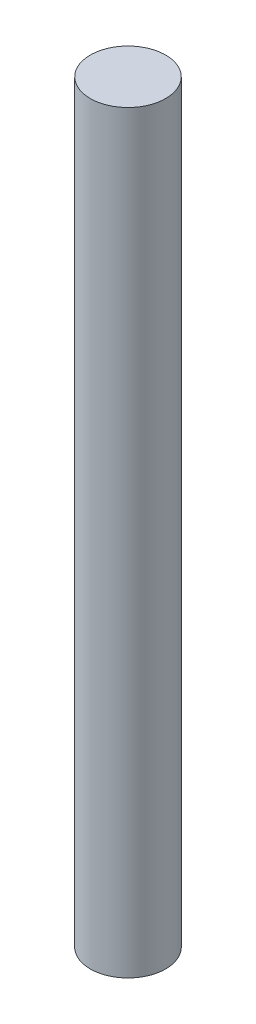
ISO-10303-21;
HEADER;
FILE_DESCRIPTION(('STEP AP214'),'2;1');
FILE_NAME('part.step','',(''),(''),'','','');
FILE_SCHEMA(('AUTOMOTIVE_DESIGN { 1 0 10303 214 1 1 1 1 }'));
ENDSEC;
DATA;
#1=APPLICATION_CONTEXT('core data for automotive mechanical design processes');
#2=APPLICATION_PROTOCOL_DEFINITION('international standard','automotive_design',2000,#1);
#3=PRODUCT_CONTEXT('',#1,'mechanical');
#4=PRODUCT('Part','Part','',(#3));
#5=PRODUCT_RELATED_PRODUCT_CATEGORY('part','',(#4));
#6=PRODUCT_DEFINITION_FORMATION('','',#4);
#7=PRODUCT_DEFINITION_CONTEXT('part definition',#1,'design');
#8=PRODUCT_DEFINITION('design','',#6,#7);
#9=PRODUCT_DEFINITION_SHAPE('','',#8);
#10=(LENGTH_UNIT() NAMED_UNIT(*) SI_UNIT(.MILLI.,.METRE.));
#11=(NAMED_UNIT(*) PLANE_ANGLE_UNIT() SI_UNIT($,.RADIAN.));
#12=(NAMED_UNIT(*) SI_UNIT($,.STERADIAN.) SOLID_ANGLE_UNIT());
#13=UNCERTAINTY_MEASURE_WITH_UNIT(LENGTH_MEASURE(1.E-05),#10,'distance_accuracy_value','');
#14=(GEOMETRIC_REPRESENTATION_CONTEXT(3) GLOBAL_UNCERTAINTY_ASSIGNED_CONTEXT((#13)) GLOBAL_UNIT_ASSIGNED_CONTEXT((#10,
#11,#12)) REPRESENTATION_CONTEXT('',''));
#15=CARTESIAN_POINT('',(0.,0.,0.));
#16=DIRECTION('',(0.,0.,1.));
#17=DIRECTION('',(1.,0.,0.));
#18=AXIS2_PLACEMENT_3D('',#15,#16,#17);
#19=CARTESIAN_POINT('',(0.,150.,0.));
#20=DIRECTION('',(0.,-1.,0.));
#21=DIRECTION('',(0.,0.,-1.));
#22=AXIS2_PLACEMENT_3D('',#19,#20,#21);
#23=CYLINDRICAL_SURFACE('',#22,7.5);
#24=CARTESIAN_POINT('',(0.,150.,0.));
#25=DIRECTION('',(0.,1.,0.));
#26=DIRECTION('',(0.,0.,1.));
#27=AXIS2_PLACEMENT_3D('',#24,#25,#26);
#28=CIRCLE('',#27,7.5);
#29=CARTESIAN_POINT('',(0.,150.,7.5));
#30=VERTEX_POINT('',#29);
#31=EDGE_CURVE('E10',#30,#30,#28,.T.);
#32=ORIENTED_EDGE('',*,*,#31,.F.);
#33=EDGE_LOOP('',(#32));
#34=FACE_BOUND('',#33,.T.);
#35=CARTESIAN_POINT('',(0.,0.,0.));
#36=DIRECTION('',(0.,1.,0.));
#37=DIRECTION('',(0.,0.,1.));
#38=AXIS2_PLACEMENT_3D('',#35,#36,#37);
#39=CIRCLE('',#38,7.5);
#40=CARTESIAN_POINT('',(0.,0.,7.5));
#41=VERTEX_POINT('',#40);
#42=EDGE_CURVE('E34',#41,#41,#39,.T.);
#43=ORIENTED_EDGE('',*,*,#42,.T.);
#44=EDGE_LOOP('',(#43));
#45=FACE_BOUND('',#44,.T.);
#46=ADVANCED_FACE('F31',(#34,#45),#23,.T.);
#47=CARTESIAN_POINT('',(0.,150.,0.));
#48=DIRECTION('',(0.,1.,0.));
#49=DIRECTION('',(0.,0.,1.));
#50=AXIS2_PLACEMENT_3D('',#47,#48,#49);
#51=PLANE('',#50);
#52=ORIENTED_EDGE('',*,*,#31,.T.);
#53=EDGE_LOOP('',(#52));
#54=FACE_BOUND('',#53,.T.);
#55=ADVANCED_FACE('F46',(#54),#51,.T.);
#56=CARTESIAN_POINT('',(0.,0.,0.));
#57=DIRECTION('',(0.,1.,0.));
#58=DIRECTION('',(0.,0.,1.));
#59=AXIS2_PLACEMENT_3D('',#56,#57,#58);
#60=PLANE('',#59);
#61=ORIENTED_EDGE('',*,*,#42,.F.);
#62=EDGE_LOOP('',(#61));
#63=FACE_BOUND('',#62,.T.);
#64=ADVANCED_FACE('F44',(#63),#60,.F.);
#65=CLOSED_SHELL('',(#46,#55,#64));
#66=MANIFOLD_SOLID_BREP('B2',#65);
#67=ADVANCED_BREP_SHAPE_REPRESENTATION('',(#18,#66),#14);
#68=SHAPE_DEFINITION_REPRESENTATION(#9,#67);
ENDSEC;
END-ISO-10303-21;
